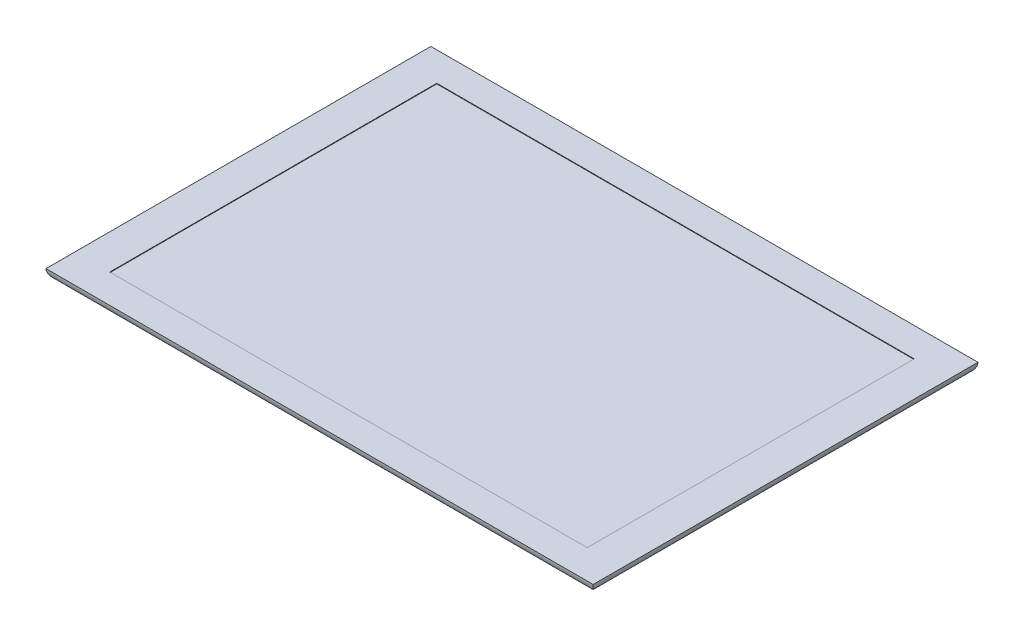
ISO-10303-21;
HEADER;
FILE_DESCRIPTION(('STEP AP214'),'2;1');
FILE_NAME('part.step','',(''),(''),'','','');
FILE_SCHEMA(('AUTOMOTIVE_DESIGN { 1 0 10303 214 1 1 1 1 }'));
ENDSEC;
DATA;
#1=APPLICATION_CONTEXT('core data for automotive mechanical design processes');
#2=APPLICATION_PROTOCOL_DEFINITION('international standard','automotive_design',2000,#1);
#3=PRODUCT_CONTEXT('',#1,'mechanical');
#4=PRODUCT('Part','Part','',(#3));
#5=PRODUCT_RELATED_PRODUCT_CATEGORY('part','',(#4));
#6=PRODUCT_DEFINITION_FORMATION('','',#4);
#7=PRODUCT_DEFINITION_CONTEXT('part definition',#1,'design');
#8=PRODUCT_DEFINITION('design','',#6,#7);
#9=PRODUCT_DEFINITION_SHAPE('','',#8);
#10=(LENGTH_UNIT() NAMED_UNIT(*) SI_UNIT(.MILLI.,.METRE.));
#11=(NAMED_UNIT(*) PLANE_ANGLE_UNIT() SI_UNIT($,.RADIAN.));
#12=(NAMED_UNIT(*) SI_UNIT($,.STERADIAN.) SOLID_ANGLE_UNIT());
#13=UNCERTAINTY_MEASURE_WITH_UNIT(LENGTH_MEASURE(1.E-05),#10,'distance_accuracy_value','');
#14=(GEOMETRIC_REPRESENTATION_CONTEXT(3) GLOBAL_UNCERTAINTY_ASSIGNED_CONTEXT((#13)) GLOBAL_UNIT_ASSIGNED_CONTEXT((#10,
#11,#12)) REPRESENTATION_CONTEXT('',''));
#15=CARTESIAN_POINT('',(0.,0.,0.));
#16=DIRECTION('',(0.,0.,1.));
#17=DIRECTION('',(1.,0.,0.));
#18=AXIS2_PLACEMENT_3D('',#15,#16,#17);
#19=CARTESIAN_POINT('',(0.,7.5,0.));
#20=DIRECTION('',(0.,-1.,0.));
#21=DIRECTION('',(0.,0.,-1.));
#22=AXIS2_PLACEMENT_3D('',#19,#20,#21);
#23=PLANE('',#22);
#24=DIRECTION('',(0.,0.,-1.));
#25=VECTOR('',#24,1.);
#26=CARTESIAN_POINT('',(187.325,7.5,131.7625));
#27=LINE('',#26,#25);
#28=CARTESIAN_POINT('',(187.325,7.5,131.7625));
#29=VERTEX_POINT('',#28);
#30=CARTESIAN_POINT('',(187.325,7.5,-131.7625));
#31=VERTEX_POINT('',#30);
#32=EDGE_CURVE('E143',#29,#31,#27,.T.);
#33=ORIENTED_EDGE('',*,*,#32,.T.);
#34=DIRECTION('',(-1.,0.,0.));
#35=VECTOR('',#34,1.);
#36=CARTESIAN_POINT('',(-187.325,7.5,-131.7625));
#37=LINE('',#36,#35);
#38=CARTESIAN_POINT('',(-187.325,7.5,-131.7625));
#39=VERTEX_POINT('',#38);
#40=EDGE_CURVE('E145',#31,#39,#37,.T.);
#41=ORIENTED_EDGE('',*,*,#40,.T.);
#42=DIRECTION('',(0.,0.,1.));
#43=VECTOR('',#42,1.);
#44=CARTESIAN_POINT('',(-187.325,7.5,131.7625));
#45=LINE('',#44,#43);
#46=CARTESIAN_POINT('',(-187.325,7.5,131.7625));
#47=VERTEX_POINT('',#46);
#48=EDGE_CURVE('E148',#39,#47,#45,.T.);
#49=ORIENTED_EDGE('',*,*,#48,.T.);
#50=DIRECTION('',(1.,0.,0.));
#51=VECTOR('',#50,1.);
#52=CARTESIAN_POINT('',(-187.325,7.5,131.7625));
#53=LINE('',#52,#51);
#54=EDGE_CURVE('E151',#47,#29,#53,.T.);
#55=ORIENTED_EDGE('',*,*,#54,.T.);
#56=EDGE_LOOP('',(#33,#41,#49,#55));
#57=FACE_BOUND('',#56,.T.);
#58=DIRECTION('',(0.,0.,-1.));
#59=VECTOR('',#58,1.);
#60=CARTESIAN_POINT('',(163.458312574644,7.5,111.9505));
#61=LINE('',#60,#59);
#62=CARTESIAN_POINT('',(163.458312574644,7.5,111.9505));
#63=VERTEX_POINT('',#62);
#64=CARTESIAN_POINT('',(163.458312574644,7.5,-111.9505));
#65=VERTEX_POINT('',#64);
#66=EDGE_CURVE('E130',#63,#65,#61,.T.);
#67=ORIENTED_EDGE('',*,*,#66,.F.);
#68=DIRECTION('',(1.,0.,0.));
#69=VECTOR('',#68,1.);
#70=CARTESIAN_POINT('',(-163.458312574644,7.5,111.9505));
#71=LINE('',#70,#69);
#72=CARTESIAN_POINT('',(-163.458312574644,7.5,111.9505));
#73=VERTEX_POINT('',#72);
#74=EDGE_CURVE('E106',#73,#63,#71,.T.);
#75=ORIENTED_EDGE('',*,*,#74,.F.);
#76=DIRECTION('',(0.,0.,1.));
#77=VECTOR('',#76,1.);
#78=CARTESIAN_POINT('',(-163.458312574644,7.5,111.9505));
#79=LINE('',#78,#77);
#80=CARTESIAN_POINT('',(-163.458312574644,7.5,-111.9505));
#81=VERTEX_POINT('',#80);
#82=EDGE_CURVE('E134',#81,#73,#79,.T.);
#83=ORIENTED_EDGE('',*,*,#82,.F.);
#84=DIRECTION('',(-1.,0.,0.));
#85=VECTOR('',#84,1.);
#86=CARTESIAN_POINT('',(-163.458312574644,7.5,-111.9505));
#87=LINE('',#86,#85);
#88=EDGE_CURVE('E132',#65,#81,#87,.T.);
#89=ORIENTED_EDGE('',*,*,#88,.F.);
#90=EDGE_LOOP('',(#67,#75,#83,#89));
#91=FACE_BOUND('',#90,.T.);
#92=ADVANCED_FACE('F34',(#57,#91),#23,.F.);
#93=CARTESIAN_POINT('',(0.,0.,0.));
#94=DIRECTION('',(0.,-1.,0.));
#95=DIRECTION('',(0.,0.,-1.));
#96=AXIS2_PLACEMENT_3D('',#93,#94,#95);
#97=PLANE('',#96);
#98=DIRECTION('',(1.,0.,0.));
#99=VECTOR('',#98,1.);
#100=CARTESIAN_POINT('',(-187.325,0.,124.14344494048));
#101=LINE('',#100,#99);
#102=CARTESIAN_POINT('',(179.70594494048,0.,124.14344494048));
#103=VERTEX_POINT('',#102);
#104=CARTESIAN_POINT('',(-179.70594494048,0.,124.14344494048));
#105=VERTEX_POINT('',#104);
#106=EDGE_CURVE('E51',#103,#105,#101,.F.);
#107=ORIENTED_EDGE('',*,*,#106,.T.);
#108=DIRECTION('',(0.,0.,1.));
#109=VECTOR('',#108,1.);
#110=CARTESIAN_POINT('',(-179.70594494048,0.,-124.14344494048));
#111=LINE('',#110,#109);
#112=CARTESIAN_POINT('',(-179.70594494048,0.,-124.14344494048));
#113=VERTEX_POINT('',#112);
#114=EDGE_CURVE('E157',#105,#113,#111,.F.);
#115=ORIENTED_EDGE('',*,*,#114,.T.);
#116=DIRECTION('',(-1.,0.,0.));
#117=VECTOR('',#116,1.);
#118=CARTESIAN_POINT('',(187.325,0.,-124.14344494048));
#119=LINE('',#118,#117);
#120=CARTESIAN_POINT('',(179.70594494048,0.,-124.14344494048));
#121=VERTEX_POINT('',#120);
#122=EDGE_CURVE('E153',#113,#121,#119,.F.);
#123=ORIENTED_EDGE('',*,*,#122,.T.);
#124=DIRECTION('',(0.,0.,-1.));
#125=VECTOR('',#124,1.);
#126=CARTESIAN_POINT('',(179.70594494048,0.,131.7625));
#127=LINE('',#126,#125);
#128=EDGE_CURVE('E56',#121,#103,#127,.F.);
#129=ORIENTED_EDGE('',*,*,#128,.T.);
#130=EDGE_LOOP('',(#107,#115,#123,#129));
#131=FACE_BOUND('',#130,.T.);
#132=ADVANCED_FACE('F183',(#131),#97,.T.);
#133=CARTESIAN_POINT('',(163.458312574644,7.5,111.9505));
#134=DIRECTION('',(-1.,0.,0.));
#135=DIRECTION('',(0.,0.,1.));
#136=AXIS2_PLACEMENT_3D('',#133,#134,#135);
#137=PLANE('',#136);
#138=DIRECTION('',(0.,0.,-1.));
#139=VECTOR('',#138,1.);
#140=CARTESIAN_POINT('',(163.458312574644,7.1,0.));
#141=LINE('',#140,#139);
#142=CARTESIAN_POINT('',(163.458312574644,7.1,111.9505));
#143=VERTEX_POINT('',#142);
#144=CARTESIAN_POINT('',(163.458312574644,7.1,-111.9505));
#145=VERTEX_POINT('',#144);
#146=EDGE_CURVE('E113',#143,#145,#141,.T.);
#147=ORIENTED_EDGE('',*,*,#146,.F.);
#148=DIRECTION('',(0.,-1.,0.));
#149=VECTOR('',#148,1.);
#150=CARTESIAN_POINT('',(163.458312574644,7.5,111.9505));
#151=LINE('',#150,#149);
#152=EDGE_CURVE('E99',#63,#143,#151,.T.);
#153=ORIENTED_EDGE('',*,*,#152,.F.);
#154=ORIENTED_EDGE('',*,*,#66,.T.);
#155=DIRECTION('',(0.,-1.,0.));
#156=VECTOR('',#155,1.);
#157=CARTESIAN_POINT('',(163.458312574644,7.5,-111.9505));
#158=LINE('',#157,#156);
#159=EDGE_CURVE('E116',#65,#145,#158,.T.);
#160=ORIENTED_EDGE('',*,*,#159,.T.);
#161=EDGE_LOOP('',(#147,#153,#154,#160));
#162=FACE_BOUND('',#161,.T.);
#163=ADVANCED_FACE('F114',(#162),#137,.T.);
#164=CARTESIAN_POINT('',(-163.458312574644,7.5,-111.9505));
#165=DIRECTION('',(0.,0.,1.));
#166=DIRECTION('',(1.,0.,0.));
#167=AXIS2_PLACEMENT_3D('',#164,#165,#166);
#168=PLANE('',#167);
#169=DIRECTION('',(1.,0.,0.));
#170=VECTOR('',#169,1.);
#171=CARTESIAN_POINT('',(0.,7.1,-111.9505));
#172=LINE('',#171,#170);
#173=CARTESIAN_POINT('',(-163.458312574644,7.1,-111.9505));
#174=VERTEX_POINT('',#173);
#175=EDGE_CURVE('E119',#174,#145,#172,.T.);
#176=ORIENTED_EDGE('',*,*,#175,.T.);
#177=ORIENTED_EDGE('',*,*,#159,.F.);
#178=ORIENTED_EDGE('',*,*,#88,.T.);
#179=DIRECTION('',(0.,-1.,0.));
#180=VECTOR('',#179,1.);
#181=CARTESIAN_POINT('',(-163.458312574644,7.5,-111.9505));
#182=LINE('',#181,#180);
#183=EDGE_CURVE('E139',#81,#174,#182,.T.);
#184=ORIENTED_EDGE('',*,*,#183,.T.);
#185=EDGE_LOOP('',(#176,#177,#178,#184));
#186=FACE_BOUND('',#185,.T.);
#187=ADVANCED_FACE('F240',(#186),#168,.T.);
#188=CARTESIAN_POINT('',(-163.458312574644,7.5,111.9505));
#189=DIRECTION('',(1.,0.,0.));
#190=DIRECTION('',(0.,0.,-1.));
#191=AXIS2_PLACEMENT_3D('',#188,#189,#190);
#192=PLANE('',#191);
#193=DIRECTION('',(0.,0.,-1.));
#194=VECTOR('',#193,1.);
#195=CARTESIAN_POINT('',(-163.458312574644,7.1,0.));
#196=LINE('',#195,#194);
#197=CARTESIAN_POINT('',(-163.458312574644,7.1,111.9505));
#198=VERTEX_POINT('',#197);
#199=EDGE_CURVE('E123',#198,#174,#196,.T.);
#200=ORIENTED_EDGE('',*,*,#199,.T.);
#201=ORIENTED_EDGE('',*,*,#183,.F.);
#202=ORIENTED_EDGE('',*,*,#82,.T.);
#203=DIRECTION('',(0.,-1.,0.));
#204=VECTOR('',#203,1.);
#205=CARTESIAN_POINT('',(-163.458312574644,7.5,111.9505));
#206=LINE('',#205,#204);
#207=EDGE_CURVE('E109',#73,#198,#206,.T.);
#208=ORIENTED_EDGE('',*,*,#207,.T.);
#209=EDGE_LOOP('',(#200,#201,#202,#208));
#210=FACE_BOUND('',#209,.T.);
#211=ADVANCED_FACE('F233',(#210),#192,.T.);
#212=CARTESIAN_POINT('',(-163.458312574644,7.5,111.9505));
#213=DIRECTION('',(0.,0.,-1.));
#214=DIRECTION('',(-1.,0.,0.));
#215=AXIS2_PLACEMENT_3D('',#212,#213,#214);
#216=PLANE('',#215);
#217=DIRECTION('',(1.,0.,0.));
#218=VECTOR('',#217,1.);
#219=CARTESIAN_POINT('',(0.,7.1,111.9505));
#220=LINE('',#219,#218);
#221=EDGE_CURVE('E103',#198,#143,#220,.T.);
#222=ORIENTED_EDGE('',*,*,#221,.F.);
#223=ORIENTED_EDGE('',*,*,#207,.F.);
#224=ORIENTED_EDGE('',*,*,#74,.T.);
#225=ORIENTED_EDGE('',*,*,#152,.T.);
#226=EDGE_LOOP('',(#222,#223,#224,#225));
#227=FACE_BOUND('',#226,.T.);
#228=ADVANCED_FACE('F101',(#227),#216,.T.);
#229=CARTESIAN_POINT('',(0.,7.1,0.));
#230=DIRECTION('',(0.,1.,0.));
#231=DIRECTION('',(0.,0.,1.));
#232=AXIS2_PLACEMENT_3D('',#229,#230,#231);
#233=PLANE('',#232);
#234=ORIENTED_EDGE('',*,*,#221,.T.);
#235=ORIENTED_EDGE('',*,*,#146,.T.);
#236=ORIENTED_EDGE('',*,*,#175,.F.);
#237=ORIENTED_EDGE('',*,*,#199,.F.);
#238=EDGE_LOOP('',(#234,#235,#236,#237));
#239=FACE_BOUND('',#238,.T.);
#240=ADVANCED_FACE('F122',(#239),#233,.T.);
#241=CARTESIAN_POINT('',(-187.325,7.62,-124.14344494048));
#242=DIRECTION('',(1.,0.,0.));
#243=DIRECTION('',(0.,0.,-1.));
#244=AXIS2_PLACEMENT_3D('',#241,#242,#243);
#245=CYLINDRICAL_SURFACE('',#244,7.62);
#246=ORIENTED_EDGE('',*,*,#122,.F.);
#247=CARTESIAN_POINT('',(-179.70594494048,7.62,-124.14344494048));
#248=DIRECTION('',(0.707106781186547,0.,-0.707106781186547));
#249=DIRECTION('',(0.707106781186547,0.,0.707106781186547));
#250=AXIS2_PLACEMENT_3D('',#247,#248,#249);
#251=ELLIPSE('',#250,10.776307345283,7.62);
#252=EDGE_CURVE('E11',#113,#39,#251,.T.);
#253=ORIENTED_EDGE('',*,*,#252,.T.);
#254=ORIENTED_EDGE('',*,*,#40,.F.);
#255=CARTESIAN_POINT('',(179.70594494048,7.62,-124.14344494048));
#256=DIRECTION('',(0.707106781186547,0.,0.707106781186547));
#257=DIRECTION('',(0.707106781186547,0.,-0.707106781186547));
#258=AXIS2_PLACEMENT_3D('',#255,#256,#257);
#259=ELLIPSE('',#258,10.776307345283,7.62);
#260=EDGE_CURVE('E43',#31,#121,#259,.F.);
#261=ORIENTED_EDGE('',*,*,#260,.T.);
#262=EDGE_LOOP('',(#246,#253,#254,#261));
#263=FACE_BOUND('',#262,.T.);
#264=ADVANCED_FACE('F174',(#263),#245,.T.);
#265=CARTESIAN_POINT('',(179.70594494048,7.62,131.7625));
#266=DIRECTION('',(0.,0.,1.));
#267=DIRECTION('',(1.,0.,0.));
#268=AXIS2_PLACEMENT_3D('',#265,#266,#267);
#269=CYLINDRICAL_SURFACE('',#268,7.62);
#270=ORIENTED_EDGE('',*,*,#260,.F.);
#271=ORIENTED_EDGE('',*,*,#32,.F.);
#272=CARTESIAN_POINT('',(179.70594494048,7.62,124.14344494048));
#273=DIRECTION('',(-0.707106781186547,0.,0.707106781186547));
#274=DIRECTION('',(-0.707106781186547,0.,-0.707106781186547));
#275=AXIS2_PLACEMENT_3D('',#272,#273,#274);
#276=ELLIPSE('',#275,10.776307345283,7.62);
#277=EDGE_CURVE('E38',#103,#29,#276,.T.);
#278=ORIENTED_EDGE('',*,*,#277,.F.);
#279=ORIENTED_EDGE('',*,*,#128,.F.);
#280=EDGE_LOOP('',(#270,#271,#278,#279));
#281=FACE_BOUND('',#280,.T.);
#282=ADVANCED_FACE('F36',(#281),#269,.T.);
#283=CARTESIAN_POINT('',(-187.325,7.62,124.14344494048));
#284=DIRECTION('',(-1.,0.,0.));
#285=DIRECTION('',(0.,0.,1.));
#286=AXIS2_PLACEMENT_3D('',#283,#284,#285);
#287=CYLINDRICAL_SURFACE('',#286,7.62);
#288=ORIENTED_EDGE('',*,*,#277,.T.);
#289=ORIENTED_EDGE('',*,*,#54,.F.);
#290=CARTESIAN_POINT('',(-179.70594494048,7.62,124.14344494048));
#291=DIRECTION('',(-0.707106781186547,0.,-0.707106781186547));
#292=DIRECTION('',(-0.707106781186547,0.,0.707106781186547));
#293=AXIS2_PLACEMENT_3D('',#290,#291,#292);
#294=ELLIPSE('',#293,10.776307345283,7.62);
#295=EDGE_CURVE('E126',#105,#47,#294,.T.);
#296=ORIENTED_EDGE('',*,*,#295,.F.);
#297=ORIENTED_EDGE('',*,*,#106,.F.);
#298=EDGE_LOOP('',(#288,#289,#296,#297));
#299=FACE_BOUND('',#298,.T.);
#300=ADVANCED_FACE('F166',(#299),#287,.T.);
#301=CARTESIAN_POINT('',(-179.70594494048,7.62,131.7625));
#302=DIRECTION('',(0.,0.,-1.));
#303=DIRECTION('',(-1.,0.,0.));
#304=AXIS2_PLACEMENT_3D('',#301,#302,#303);
#305=CYLINDRICAL_SURFACE('',#304,7.62);
#306=ORIENTED_EDGE('',*,*,#252,.F.);
#307=ORIENTED_EDGE('',*,*,#114,.F.);
#308=ORIENTED_EDGE('',*,*,#295,.T.);
#309=ORIENTED_EDGE('',*,*,#48,.F.);
#310=EDGE_LOOP('',(#306,#307,#308,#309));
#311=FACE_BOUND('',#310,.T.);
#312=ADVANCED_FACE('F164',(#311),#305,.T.);
#313=CLOSED_SHELL('',(#92,#132,#163,#187,#211,#228,#240,#264,#282,#300,#312));
#314=MANIFOLD_SOLID_BREP('B2',#313);
#315=ADVANCED_BREP_SHAPE_REPRESENTATION('',(#18,#314),#14);
#316=SHAPE_DEFINITION_REPRESENTATION(#9,#315);
ENDSEC;
END-ISO-10303-21;
